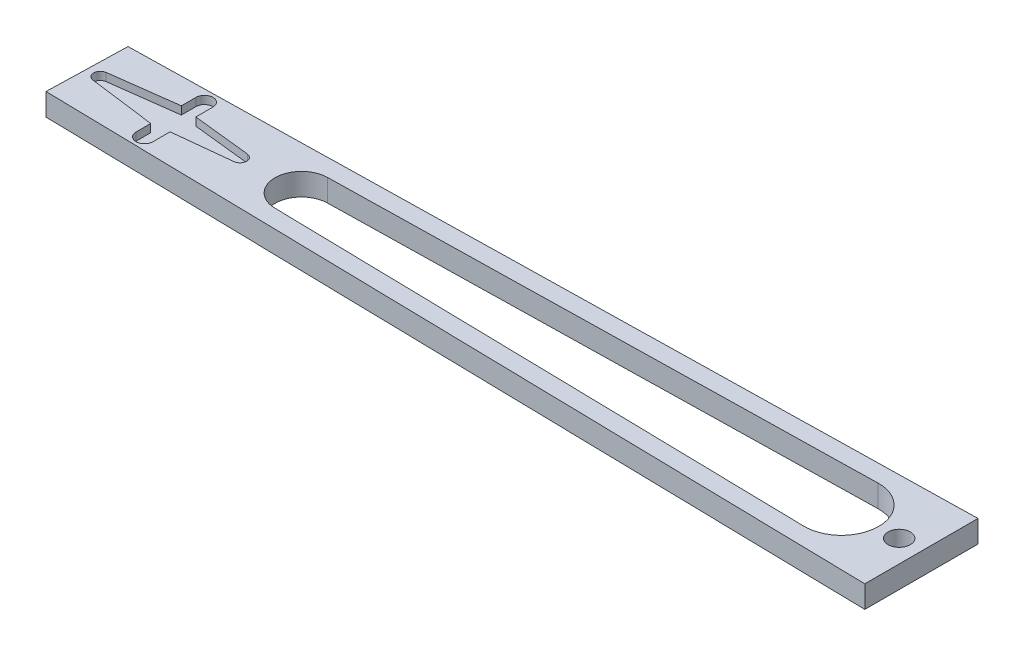
ISO-10303-21;
HEADER;
FILE_DESCRIPTION(('STEP AP214'),'2;1');
FILE_NAME('part.step','',(''),(''),'','','');
FILE_SCHEMA(('AUTOMOTIVE_DESIGN { 1 0 10303 214 1 1 1 1 }'));
ENDSEC;
DATA;
#1=APPLICATION_CONTEXT('core data for automotive mechanical design processes');
#2=APPLICATION_PROTOCOL_DEFINITION('international standard','automotive_design',2000,#1);
#3=PRODUCT_CONTEXT('',#1,'mechanical');
#4=PRODUCT('Part','Part','',(#3));
#5=PRODUCT_RELATED_PRODUCT_CATEGORY('part','',(#4));
#6=PRODUCT_DEFINITION_FORMATION('','',#4);
#7=PRODUCT_DEFINITION_CONTEXT('part definition',#1,'design');
#8=PRODUCT_DEFINITION('design','',#6,#7);
#9=PRODUCT_DEFINITION_SHAPE('','',#8);
#10=(LENGTH_UNIT() NAMED_UNIT(*) SI_UNIT(.MILLI.,.METRE.));
#11=(NAMED_UNIT(*) PLANE_ANGLE_UNIT() SI_UNIT($,.RADIAN.));
#12=(NAMED_UNIT(*) SI_UNIT($,.STERADIAN.) SOLID_ANGLE_UNIT());
#13=UNCERTAINTY_MEASURE_WITH_UNIT(LENGTH_MEASURE(1.E-05),#10,'distance_accuracy_value','');
#14=(GEOMETRIC_REPRESENTATION_CONTEXT(3) GLOBAL_UNCERTAINTY_ASSIGNED_CONTEXT((#13)) GLOBAL_UNIT_ASSIGNED_CONTEXT((#10,
#11,#12)) REPRESENTATION_CONTEXT('',''));
#15=CARTESIAN_POINT('',(0.,0.,0.));
#16=DIRECTION('',(0.,0.,1.));
#17=DIRECTION('',(1.,0.,0.));
#18=AXIS2_PLACEMENT_3D('',#15,#16,#17);
#19=CARTESIAN_POINT('',(79.6446575003003,5.,51.065389200042));
#20=DIRECTION('',(0.,-1.,0.));
#21=DIRECTION('',(0.,0.,-1.));
#22=AXIS2_PLACEMENT_3D('',#19,#20,#21);
#23=CYLINDRICAL_SURFACE('',#22,8.38109241557405);
#24=CARTESIAN_POINT('',(79.6446575003003,0.,51.065389200042));
#25=DIRECTION('',(0.,1.,0.));
#26=DIRECTION('',(0.,0.,1.));
#27=AXIS2_PLACEMENT_3D('',#24,#25,#26);
#28=CIRCLE('',#27,8.38109241557405);
#29=CARTESIAN_POINT('',(79.4739793423792,0.,59.4447435334499));
#30=VERTEX_POINT('',#29);
#31=CARTESIAN_POINT('',(79.4807981316153,0.,42.685898750994));
#32=VERTEX_POINT('',#31);
#33=EDGE_CURVE('E321',#30,#32,#28,.T.);
#34=ORIENTED_EDGE('',*,*,#33,.F.);
#35=DIRECTION('',(0.,-1.,0.));
#36=VECTOR('',#35,1.);
#37=CARTESIAN_POINT('',(79.4739793423792,5.,59.4447435334499));
#38=LINE('',#37,#36);
#39=CARTESIAN_POINT('',(79.4739793423792,5.,59.4447435334499));
#40=VERTEX_POINT('',#39);
#41=EDGE_CURVE('E11',#40,#30,#38,.T.);
#42=ORIENTED_EDGE('',*,*,#41,.F.);
#43=CARTESIAN_POINT('',(79.6446575003003,5.,51.065389200042));
#44=DIRECTION('',(0.,1.,0.));
#45=DIRECTION('',(0.,0.,1.));
#46=AXIS2_PLACEMENT_3D('',#43,#44,#45);
#47=CIRCLE('',#46,8.38109241557405);
#48=CARTESIAN_POINT('',(79.4807981316153,5.,42.685898750994));
#49=VERTEX_POINT('',#48);
#50=EDGE_CURVE('E289',#40,#49,#47,.T.);
#51=ORIENTED_EDGE('',*,*,#50,.T.);
#52=DIRECTION('',(0.,-1.,0.));
#53=VECTOR('',#52,1.);
#54=CARTESIAN_POINT('',(79.4807981316153,5.,42.685898750994));
#55=LINE('',#54,#53);
#56=EDGE_CURVE('E340',#49,#32,#55,.T.);
#57=ORIENTED_EDGE('',*,*,#56,.T.);
#58=EDGE_LOOP('',(#34,#42,#51,#57));
#59=FACE_BOUND('',#58,.T.);
#60=ADVANCED_FACE('F39',(#59),#23,.F.);
#61=CARTESIAN_POINT('',(-1.17736194692665,5.,57.8019651262589));
#62=DIRECTION('',(0.0203646672125864,0.,-0.99979261866115));
#63=DIRECTION('',(-0.99979261866115,0.,-0.0203646672125864));
#64=AXIS2_PLACEMENT_3D('',#61,#62,#63);
#65=PLANE('',#64);
#66=DIRECTION('',(0.99979261866115,0.,0.0203646672125864));
#67=VECTOR('',#66,1.);
#68=CARTESIAN_POINT('',(-1.17736194692665,0.,57.8019651262589));
#69=LINE('',#68,#67);
#70=CARTESIAN_POINT('',(-42.0612290827421,0.,56.9692060789883));
#71=VERTEX_POINT('',#70);
#72=EDGE_CURVE('E325',#71,#30,#69,.T.);
#73=ORIENTED_EDGE('',*,*,#72,.F.);
#74=DIRECTION('',(0.,-1.,0.));
#75=VECTOR('',#74,1.);
#76=CARTESIAN_POINT('',(-42.0612290827421,5.,56.9692060789883));
#77=LINE('',#76,#75);
#78=CARTESIAN_POINT('',(-42.0612290827421,5.,56.9692060789883));
#79=VERTEX_POINT('',#78);
#80=EDGE_CURVE('E49',#79,#71,#77,.T.);
#81=ORIENTED_EDGE('',*,*,#80,.F.);
#82=DIRECTION('',(0.99979261866115,0.,0.0203646672125864));
#83=VECTOR('',#82,1.);
#84=CARTESIAN_POINT('',(-1.17736194692665,5.,57.8019651262589));
#85=LINE('',#84,#83);
#86=EDGE_CURVE('E293',#79,#40,#85,.T.);
#87=ORIENTED_EDGE('',*,*,#86,.T.);
#88=ORIENTED_EDGE('',*,*,#41,.T.);
#89=EDGE_LOOP('',(#73,#81,#87,#88));
#90=FACE_BOUND('',#89,.T.);
#91=ADVANCED_FACE('F432',(#90),#65,.T.);
#92=CARTESIAN_POINT('',(-41.9399672293329,5.,51.0159192072626));
#93=DIRECTION('',(0.,-1.,0.));
#94=DIRECTION('',(0.,0.,-1.));
#95=AXIS2_PLACEMENT_3D('',#92,#93,#94);
#96=CYLINDRICAL_SURFACE('',#95,5.95452172841397);
#97=CARTESIAN_POINT('',(-41.9399672293329,0.,51.0159192072626));
#98=DIRECTION('',(0.,1.,0.));
#99=DIRECTION('',(0.,0.,1.));
#100=AXIS2_PLACEMENT_3D('',#97,#98,#99);
#101=CIRCLE('',#100,5.95452172841397);
#102=CARTESIAN_POINT('',(-42.0563845318585,0.,45.0625356293443));
#103=VERTEX_POINT('',#102);
#104=EDGE_CURVE('E329',#103,#71,#101,.T.);
#105=ORIENTED_EDGE('',*,*,#104,.F.);
#106=DIRECTION('',(0.,-1.,0.));
#107=VECTOR('',#106,1.);
#108=CARTESIAN_POINT('',(-42.0563845318585,5.,45.0625356293443));
#109=LINE('',#108,#107);
#110=CARTESIAN_POINT('',(-42.0563845318585,5.,45.0625356293443));
#111=VERTEX_POINT('',#110);
#112=EDGE_CURVE('E343',#111,#103,#109,.T.);
#113=ORIENTED_EDGE('',*,*,#112,.F.);
#114=CARTESIAN_POINT('',(-41.9399672293329,5.,51.0159192072626));
#115=DIRECTION('',(0.,1.,0.));
#116=DIRECTION('',(0.,0.,1.));
#117=AXIS2_PLACEMENT_3D('',#114,#115,#116);
#118=CIRCLE('',#117,5.95452172841397);
#119=EDGE_CURVE('E297',#111,#79,#118,.T.);
#120=ORIENTED_EDGE('',*,*,#119,.T.);
#121=ORIENTED_EDGE('',*,*,#80,.T.);
#122=EDGE_LOOP('',(#105,#113,#120,#121));
#123=FACE_BOUND('',#122,.T.);
#124=ADVANCED_FACE('F438',(#123),#96,.F.);
#125=CARTESIAN_POINT('',(-1.25578519073497,5.,61.8060064034692));
#126=DIRECTION('',(0.0203139813144181,0.,-0.999793649791374));
#127=DIRECTION('',(-0.999793649791374,0.,-0.0203139813144181));
#128=AXIS2_PLACEMENT_3D('',#125,#126,#127);
#129=PLANE('',#128);
#130=DIRECTION('',(0.999793649791375,0.,0.0203139813144181));
#131=VECTOR('',#130,1.);
#132=CARTESIAN_POINT('',(-1.25578519073497,0.,61.8060064034692));
#133=LINE('',#132,#131);
#134=CARTESIAN_POINT('',(-90.4800222588656,0.,59.9931328320344));
#135=VERTEX_POINT('',#134);
#136=CARTESIAN_POINT('',(97.6446575003003,0.,63.8154828041571));
#137=VERTEX_POINT('',#136);
#138=EDGE_CURVE('E230',#135,#137,#133,.T.);
#139=ORIENTED_EDGE('',*,*,#138,.T.);
#140=DIRECTION('',(0.,-1.,0.));
#141=VECTOR('',#140,1.);
#142=CARTESIAN_POINT('',(97.6446575003003,5.,63.8154828041571));
#143=LINE('',#142,#141);
#144=CARTESIAN_POINT('',(97.6446575003003,5.,63.8154828041571));
#145=VERTEX_POINT('',#144);
#146=EDGE_CURVE('E344',#145,#137,#143,.T.);
#147=ORIENTED_EDGE('',*,*,#146,.F.);
#148=DIRECTION('',(0.999793649791375,0.,0.0203139813144181));
#149=VECTOR('',#148,1.);
#150=CARTESIAN_POINT('',(-1.25578519073497,5.,61.8060064034692));
#151=LINE('',#150,#149);
#152=CARTESIAN_POINT('',(-90.4800222588656,5.,59.9931328320344));
#153=VERTEX_POINT('',#152);
#154=EDGE_CURVE('E276',#153,#145,#151,.T.);
#155=ORIENTED_EDGE('',*,*,#154,.F.);
#156=DIRECTION('',(0.,-1.,0.));
#157=VECTOR('',#156,1.);
#158=CARTESIAN_POINT('',(-90.4800222588656,5.,59.9931328320344));
#159=LINE('',#158,#157);
#160=EDGE_CURVE('E349',#153,#135,#159,.T.);
#161=ORIENTED_EDGE('',*,*,#160,.T.);
#162=EDGE_LOOP('',(#139,#147,#155,#161));
#163=FACE_BOUND('',#162,.T.);
#164=ADVANCED_FACE('F456',(#163),#129,.F.);
#165=CARTESIAN_POINT('',(97.6446575003003,5.,0.));
#166=DIRECTION('',(-1.,0.,0.));
#167=DIRECTION('',(0.,0.,1.));
#168=AXIS2_PLACEMENT_3D('',#165,#166,#167);
#169=PLANE('',#168);
#170=DIRECTION('',(0.,0.,-1.));
#171=VECTOR('',#170,1.);
#172=CARTESIAN_POINT('',(97.6446575003003,0.,0.));
#173=LINE('',#172,#171);
#174=CARTESIAN_POINT('',(97.6446575003003,0.,38.3299431695327));
#175=VERTEX_POINT('',#174);
#176=EDGE_CURVE('E312',#137,#175,#173,.T.);
#177=ORIENTED_EDGE('',*,*,#176,.T.);
#178=DIRECTION('',(0.,-1.,0.));
#179=VECTOR('',#178,1.);
#180=CARTESIAN_POINT('',(97.6446575003003,5.,38.3299431695327));
#181=LINE('',#180,#179);
#182=CARTESIAN_POINT('',(97.6446575003003,5.,38.3299431695327));
#183=VERTEX_POINT('',#182);
#184=EDGE_CURVE('E357',#183,#175,#181,.T.);
#185=ORIENTED_EDGE('',*,*,#184,.F.);
#186=DIRECTION('',(0.,0.,-1.));
#187=VECTOR('',#186,1.);
#188=CARTESIAN_POINT('',(97.6446575003003,5.,0.));
#189=LINE('',#188,#187);
#190=EDGE_CURVE('E280',#145,#183,#189,.T.);
#191=ORIENTED_EDGE('',*,*,#190,.F.);
#192=ORIENTED_EDGE('',*,*,#146,.T.);
#193=EDGE_LOOP('',(#177,#185,#191,#192));
#194=FACE_BOUND('',#193,.T.);
#195=ADVANCED_FACE('F452',(#194),#169,.F.);
#196=CARTESIAN_POINT('',(0.786572502605061,5.,40.2239849082597));
#197=DIRECTION('',(0.0195510752727798,0.,0.999808859460486));
#198=DIRECTION('',(0.999808859460486,0.,-0.0195510752727798));
#199=AXIS2_PLACEMENT_3D('',#196,#197,#198);
#200=PLANE('',#199);
#201=DIRECTION('',(-0.999808859460486,0.,0.0195510752727798));
#202=VECTOR('',#201,1.);
#203=CARTESIAN_POINT('',(0.786572502605061,0.,40.2239849082597));
#204=LINE('',#203,#202);
#205=CARTESIAN_POINT('',(-90.0051032092329,0.,41.9993991478793));
#206=VERTEX_POINT('',#205);
#207=EDGE_CURVE('E315',#175,#206,#204,.T.);
#208=ORIENTED_EDGE('',*,*,#207,.T.);
#209=DIRECTION('',(0.,-1.,0.));
#210=VECTOR('',#209,1.);
#211=CARTESIAN_POINT('',(-90.0051032092329,5.,41.9993991478793));
#212=LINE('',#211,#210);
#213=CARTESIAN_POINT('',(-90.0051032092329,5.,41.9993991478793));
#214=VERTEX_POINT('',#213);
#215=EDGE_CURVE('E353',#214,#206,#212,.T.);
#216=ORIENTED_EDGE('',*,*,#215,.F.);
#217=DIRECTION('',(-0.999808859460486,0.,0.0195510752727798));
#218=VECTOR('',#217,1.);
#219=CARTESIAN_POINT('',(0.786572502605061,5.,40.2239849082597));
#220=LINE('',#219,#218);
#221=EDGE_CURVE('E283',#183,#214,#220,.T.);
#222=ORIENTED_EDGE('',*,*,#221,.F.);
#223=ORIENTED_EDGE('',*,*,#184,.T.);
#224=EDGE_LOOP('',(#208,#216,#222,#223));
#225=FACE_BOUND('',#224,.T.);
#226=ADVANCED_FACE('F449',(#225),#200,.F.);
#227=CARTESIAN_POINT('',(-70.5502544115956,5.,44.2474834915236));
#228=DIRECTION('',(0.,-1.,0.));
#229=DIRECTION('',(0.,0.,-1.));
#230=AXIS2_PLACEMENT_3D('',#227,#228,#229);
#231=CYLINDRICAL_SURFACE('',#230,1.90000000000001);
#232=CARTESIAN_POINT('',(-70.5502544115956,3.2,44.2474834915236));
#233=DIRECTION('',(0.,1.,0.));
#234=DIRECTION('',(0.,0.,1.));
#235=AXIS2_PLACEMENT_3D('',#232,#233,#234);
#236=CIRCLE('',#235,1.90000000000001);
#237=CARTESIAN_POINT('',(-68.6502544115956,3.2,44.2474834915236));
#238=VERTEX_POINT('',#237);
#239=CARTESIAN_POINT('',(-72.4502544115956,3.2,44.2474834915236));
#240=VERTEX_POINT('',#239);
#241=EDGE_CURVE('E57',#238,#240,#236,.T.);
#242=ORIENTED_EDGE('',*,*,#241,.F.);
#243=DIRECTION('',(0.,-1.,0.));
#244=VECTOR('',#243,1.);
#245=CARTESIAN_POINT('',(-68.6502544115956,5.,44.2474834915236));
#246=LINE('',#245,#244);
#247=CARTESIAN_POINT('',(-68.6502544115956,5.,44.2474834915236));
#248=VERTEX_POINT('',#247);
#249=EDGE_CURVE('E43',#248,#238,#246,.T.);
#250=ORIENTED_EDGE('',*,*,#249,.F.);
#251=CARTESIAN_POINT('',(-70.5502544115956,5.,44.2474834915236));
#252=DIRECTION('',(0.,1.,0.));
#253=DIRECTION('',(0.,0.,1.));
#254=AXIS2_PLACEMENT_3D('',#251,#252,#253);
#255=CIRCLE('',#254,1.90000000000001);
#256=CARTESIAN_POINT('',(-72.4502544115956,5.,44.2474834915236));
#257=VERTEX_POINT('',#256);
#258=EDGE_CURVE('E231',#248,#257,#255,.T.);
#259=ORIENTED_EDGE('',*,*,#258,.T.);
#260=DIRECTION('',(0.,-1.,0.));
#261=VECTOR('',#260,1.);
#262=CARTESIAN_POINT('',(-72.4502544115956,5.,44.2474834915236));
#263=LINE('',#262,#261);
#264=EDGE_CURVE('E190',#257,#240,#263,.T.);
#265=ORIENTED_EDGE('',*,*,#264,.T.);
#266=EDGE_LOOP('',(#242,#250,#259,#265));
#267=FACE_BOUND('',#266,.T.);
#268=ADVANCED_FACE('F41',(#267),#231,.F.);
#269=CARTESIAN_POINT('',(-68.6502544115956,5.,0.));
#270=DIRECTION('',(-1.,0.,0.));
#271=DIRECTION('',(0.,0.,1.));
#272=AXIS2_PLACEMENT_3D('',#269,#270,#271);
#273=PLANE('',#272);
#274=DIRECTION('',(0.,0.,-1.));
#275=VECTOR('',#274,1.);
#276=CARTESIAN_POINT('',(-68.6502544115956,3.2,48.0974834915235));
#277=LINE('',#276,#275);
#278=CARTESIAN_POINT('',(-68.6502544115956,3.2,48.0974834915235));
#279=VERTEX_POINT('',#278);
#280=EDGE_CURVE('E64',#279,#238,#277,.T.);
#281=ORIENTED_EDGE('',*,*,#280,.F.);
#282=DIRECTION('',(0.,-1.,0.));
#283=VECTOR('',#282,1.);
#284=CARTESIAN_POINT('',(-68.6502544115956,5.,48.0974834915235));
#285=LINE('',#284,#283);
#286=CARTESIAN_POINT('',(-68.6502544115956,5.,48.0974834915235));
#287=VERTEX_POINT('',#286);
#288=EDGE_CURVE('E395',#287,#279,#285,.T.);
#289=ORIENTED_EDGE('',*,*,#288,.F.);
#290=DIRECTION('',(0.,0.,-1.));
#291=VECTOR('',#290,1.);
#292=CARTESIAN_POINT('',(-68.6502544115956,5.,0.));
#293=LINE('',#292,#291);
#294=EDGE_CURVE('E235',#287,#248,#293,.T.);
#295=ORIENTED_EDGE('',*,*,#294,.T.);
#296=ORIENTED_EDGE('',*,*,#249,.T.);
#297=EDGE_LOOP('',(#281,#289,#295,#296));
#298=FACE_BOUND('',#297,.T.);
#299=ADVANCED_FACE('F400',(#298),#273,.T.);
#300=CARTESIAN_POINT('',(-5.96789962169583,5.,54.910108873483));
#301=DIRECTION('',(-0.108048615095357,0.,0.994145611455372));
#302=DIRECTION('',(0.994145611455372,0.,0.108048615095357));
#303=AXIS2_PLACEMENT_3D('',#300,#301,#302);
#304=PLANE('',#303);
#305=DIRECTION('',(-0.994145611455372,0.,-0.108048615095357));
#306=VECTOR('',#305,1.);
#307=CARTESIAN_POINT('',(-55.6448437245371,3.2,49.5109752348768));
#308=LINE('',#307,#306);
#309=CARTESIAN_POINT('',(-55.6448437245371,3.2,49.5109752348768));
#310=VERTEX_POINT('',#309);
#311=EDGE_CURVE('E403',#310,#279,#308,.T.);
#312=ORIENTED_EDGE('',*,*,#311,.F.);
#313=DIRECTION('',(0.,-1.,0.));
#314=VECTOR('',#313,1.);
#315=CARTESIAN_POINT('',(-55.6448437245371,5.,49.5109752348768));
#316=LINE('',#315,#314);
#317=CARTESIAN_POINT('',(-55.6448437245371,5.,49.5109752348768));
#318=VERTEX_POINT('',#317);
#319=EDGE_CURVE('E392',#318,#310,#316,.T.);
#320=ORIENTED_EDGE('',*,*,#319,.F.);
#321=DIRECTION('',(-0.994145611455372,0.,-0.108048615095357));
#322=VECTOR('',#321,1.);
#323=CARTESIAN_POINT('',(-5.96789962169583,5.,54.910108873483));
#324=LINE('',#323,#322);
#325=EDGE_CURVE('E240',#318,#287,#324,.T.);
#326=ORIENTED_EDGE('',*,*,#325,.T.);
#327=ORIENTED_EDGE('',*,*,#288,.T.);
#328=EDGE_LOOP('',(#312,#320,#326,#327));
#329=FACE_BOUND('',#328,.T.);
#330=ADVANCED_FACE('F423',(#329),#304,.T.);
#331=CARTESIAN_POINT('',(-55.8077951531249,5.,51.0102767064218));
#332=DIRECTION('',(0.,-1.,0.));
#333=DIRECTION('',(0.,0.,-1.));
#334=AXIS2_PLACEMENT_3D('',#331,#332,#333);
#335=CYLINDRICAL_SURFACE('',#334,1.5081306543718);
#336=CARTESIAN_POINT('',(-55.8077951531249,3.2,51.0102767064218));
#337=DIRECTION('',(0.,1.,0.));
#338=DIRECTION('',(0.,0.,1.));
#339=AXIS2_PLACEMENT_3D('',#336,#337,#338);
#340=CIRCLE('',#339,1.5081306543718);
#341=CARTESIAN_POINT('',(-55.64088875901,3.2,52.509143053452));
#342=VERTEX_POINT('',#341);
#343=EDGE_CURVE('E406',#342,#310,#340,.T.);
#344=ORIENTED_EDGE('',*,*,#343,.F.);
#345=DIRECTION('',(0.,-1.,0.));
#346=VECTOR('',#345,1.);
#347=CARTESIAN_POINT('',(-55.64088875901,5.,52.509143053452));
#348=LINE('',#347,#346);
#349=CARTESIAN_POINT('',(-55.64088875901,5.,52.509143053452));
#350=VERTEX_POINT('',#349);
#351=EDGE_CURVE('E388',#350,#342,#348,.T.);
#352=ORIENTED_EDGE('',*,*,#351,.F.);
#353=CARTESIAN_POINT('',(-55.8077951531249,5.,51.0102767064218));
#354=DIRECTION('',(0.,1.,0.));
#355=DIRECTION('',(0.,0.,1.));
#356=AXIS2_PLACEMENT_3D('',#353,#354,#355);
#357=CIRCLE('',#356,1.5081306543718);
#358=EDGE_CURVE('E244',#350,#318,#357,.T.);
#359=ORIENTED_EDGE('',*,*,#358,.T.);
#360=ORIENTED_EDGE('',*,*,#319,.T.);
#361=EDGE_LOOP('',(#344,#352,#359,#360));
#362=FACE_BOUND('',#361,.T.);
#363=ADVANCED_FACE('F412',(#362),#335,.F.);
#364=CARTESIAN_POINT('',(4.91404797201048,5.,46.0468089448067));
#365=DIRECTION('',(0.106115976085142,0.,0.994353759795526));
#366=DIRECTION('',(0.994353759795526,0.,-0.106115976085142));
#367=AXIS2_PLACEMENT_3D('',#364,#365,#366);
#368=PLANE('',#367);
#369=ORIENTED_EDGE('',*,*,#351,.T.);
#370=DIRECTION('',(-0.994353759795526,0.,0.106115976085142));
#371=VECTOR('',#370,1.);
#372=CARTESIAN_POINT('',(-55.64088875901,3.2,52.509143053452));
#373=LINE('',#372,#371);
#374=CARTESIAN_POINT('',(-68.6502544115956,3.2,53.8974834915235));
#375=VERTEX_POINT('',#374);
#376=EDGE_CURVE('E227',#342,#375,#373,.T.);
#377=ORIENTED_EDGE('',*,*,#376,.T.);
#378=DIRECTION('',(0.,-1.,0.));
#379=VECTOR('',#378,1.);
#380=CARTESIAN_POINT('',(-68.6502544115956,5.,53.8974834915235));
#381=LINE('',#380,#379);
#382=CARTESIAN_POINT('',(-68.6502544115956,5.,53.8974834915235));
#383=VERTEX_POINT('',#382);
#384=EDGE_CURVE('E384',#383,#375,#381,.T.);
#385=ORIENTED_EDGE('',*,*,#384,.F.);
#386=DIRECTION('',(-0.994353759795526,0.,0.106115976085142));
#387=VECTOR('',#386,1.);
#388=CARTESIAN_POINT('',(4.91404797201048,5.,46.0468089448067));
#389=LINE('',#388,#387);
#390=EDGE_CURVE('E248',#350,#383,#389,.T.);
#391=ORIENTED_EDGE('',*,*,#390,.F.);
#392=EDGE_LOOP('',(#369,#377,#385,#391));
#393=FACE_BOUND('',#392,.T.);
#394=ADVANCED_FACE('F415',(#393),#368,.F.);
#395=CARTESIAN_POINT('',(-68.6502544115954,5.,-2.47458094461453E-13));
#396=DIRECTION('',(-1.,0.,0.));
#397=DIRECTION('',(0.,0.,1.));
#398=AXIS2_PLACEMENT_3D('',#395,#396,#397);
#399=PLANE('',#398);
#400=DIRECTION('',(0.,0.,-1.));
#401=VECTOR('',#400,1.);
#402=CARTESIAN_POINT('',(-68.6502544115956,3.2,57.7474834915236));
#403=LINE('',#402,#401);
#404=CARTESIAN_POINT('',(-68.6502544115956,3.2,57.7474834915236));
#405=VERTEX_POINT('',#404);
#406=EDGE_CURVE('E223',#405,#375,#403,.T.);
#407=ORIENTED_EDGE('',*,*,#406,.F.);
#408=DIRECTION('',(0.,-1.,0.));
#409=VECTOR('',#408,1.);
#410=CARTESIAN_POINT('',(-68.6502544115956,5.,57.7474834915236));
#411=LINE('',#410,#409);
#412=CARTESIAN_POINT('',(-68.6502544115956,5.,57.7474834915236));
#413=VERTEX_POINT('',#412);
#414=EDGE_CURVE('E380',#413,#405,#411,.T.);
#415=ORIENTED_EDGE('',*,*,#414,.F.);
#416=DIRECTION('',(0.,0.,-1.));
#417=VECTOR('',#416,1.);
#418=CARTESIAN_POINT('',(-68.6502544115954,5.,-2.47458094461453E-13));
#419=LINE('',#418,#417);
#420=EDGE_CURVE('E251',#413,#383,#419,.T.);
#421=ORIENTED_EDGE('',*,*,#420,.T.);
#422=ORIENTED_EDGE('',*,*,#384,.T.);
#423=EDGE_LOOP('',(#407,#415,#421,#422));
#424=FACE_BOUND('',#423,.T.);
#425=ADVANCED_FACE('F481',(#424),#399,.T.);
#426=CARTESIAN_POINT('',(-70.5502544115956,5.,57.7474834915236));
#427=DIRECTION('',(0.,-1.,0.));
#428=DIRECTION('',(0.,0.,-1.));
#429=AXIS2_PLACEMENT_3D('',#426,#427,#428);
#430=CYLINDRICAL_SURFACE('',#429,1.9);
#431=CARTESIAN_POINT('',(-70.5502544115956,3.2,57.7474834915236));
#432=DIRECTION('',(0.,1.,0.));
#433=DIRECTION('',(0.,0.,1.));
#434=AXIS2_PLACEMENT_3D('',#431,#432,#433);
#435=CIRCLE('',#434,1.9);
#436=CARTESIAN_POINT('',(-72.4502544115956,3.2,57.7474834915236));
#437=VERTEX_POINT('',#436);
#438=EDGE_CURVE('E219',#437,#405,#435,.T.);
#439=ORIENTED_EDGE('',*,*,#438,.F.);
#440=DIRECTION('',(0.,-1.,0.));
#441=VECTOR('',#440,1.);
#442=CARTESIAN_POINT('',(-72.4502544115956,5.,57.7474834915236));
#443=LINE('',#442,#441);
#444=CARTESIAN_POINT('',(-72.4502544115956,5.,57.7474834915236));
#445=VERTEX_POINT('',#444);
#446=EDGE_CURVE('E376',#445,#437,#443,.T.);
#447=ORIENTED_EDGE('',*,*,#446,.F.);
#448=CARTESIAN_POINT('',(-70.5502544115956,5.,57.7474834915236));
#449=DIRECTION('',(0.,1.,0.));
#450=DIRECTION('',(0.,0.,1.));
#451=AXIS2_PLACEMENT_3D('',#448,#449,#450);
#452=CIRCLE('',#451,1.9);
#453=EDGE_CURVE('E255',#445,#413,#452,.T.);
#454=ORIENTED_EDGE('',*,*,#453,.T.);
#455=ORIENTED_EDGE('',*,*,#414,.T.);
#456=EDGE_LOOP('',(#439,#447,#454,#455));
#457=FACE_BOUND('',#456,.T.);
#458=ADVANCED_FACE('F477',(#457),#430,.F.);
#459=CARTESIAN_POINT('',(-72.4502544115954,5.,-3.04681593135245E-13));
#460=DIRECTION('',(1.,0.,0.));
#461=DIRECTION('',(0.,0.,-1.));
#462=AXIS2_PLACEMENT_3D('',#459,#460,#461);
#463=PLANE('',#462);
#464=DIRECTION('',(0.,0.,1.));
#465=VECTOR('',#464,1.);
#466=CARTESIAN_POINT('',(-72.4502544115956,3.2,54.4474834915236));
#467=LINE('',#466,#465);
#468=CARTESIAN_POINT('',(-72.4502544115956,3.2,54.4474834915236));
#469=VERTEX_POINT('',#468);
#470=EDGE_CURVE('E215',#469,#437,#467,.T.);
#471=ORIENTED_EDGE('',*,*,#470,.F.);
#472=DIRECTION('',(0.,-1.,0.));
#473=VECTOR('',#472,1.);
#474=CARTESIAN_POINT('',(-72.4502544115956,5.,54.4474834915236));
#475=LINE('',#474,#473);
#476=CARTESIAN_POINT('',(-72.4502544115956,5.,54.4474834915236));
#477=VERTEX_POINT('',#476);
#478=EDGE_CURVE('E372',#477,#469,#475,.T.);
#479=ORIENTED_EDGE('',*,*,#478,.F.);
#480=DIRECTION('',(0.,0.,1.));
#481=VECTOR('',#480,1.);
#482=CARTESIAN_POINT('',(-72.4502544115954,5.,-3.04681593135245E-13));
#483=LINE('',#482,#481);
#484=EDGE_CURVE('E259',#477,#445,#483,.T.);
#485=ORIENTED_EDGE('',*,*,#484,.T.);
#486=ORIENTED_EDGE('',*,*,#446,.T.);
#487=EDGE_LOOP('',(#471,#479,#485,#486));
#488=FACE_BOUND('',#487,.T.);
#489=ADVANCED_FACE('F473',(#488),#463,.T.);
#490=CARTESIAN_POINT('',(-8.22707381919204,5.,62.8537987521285));
#491=DIRECTION('',(0.129785160623963,0.,-0.991542138328882));
#492=DIRECTION('',(-0.991542138328882,0.,-0.129785160623963));
#493=AXIS2_PLACEMENT_3D('',#490,#491,#492);
#494=PLANE('',#493);
#495=DIRECTION('',(0.991542138328882,0.,0.129785160623963));
#496=VECTOR('',#495,1.);
#497=CARTESIAN_POINT('',(-87.4449321525315,3.2,52.4847966990169));
#498=LINE('',#497,#496);
#499=CARTESIAN_POINT('',(-87.4449321525315,3.2,52.4847966990169));
#500=VERTEX_POINT('',#499);
#501=EDGE_CURVE('E211',#500,#469,#498,.T.);
#502=ORIENTED_EDGE('',*,*,#501,.F.);
#503=DIRECTION('',(0.,-1.,0.));
#504=VECTOR('',#503,1.);
#505=CARTESIAN_POINT('',(-87.4449321525315,5.,52.4847966990169));
#506=LINE('',#505,#504);
#507=CARTESIAN_POINT('',(-87.4449321525315,5.,52.4847966990169));
#508=VERTEX_POINT('',#507);
#509=EDGE_CURVE('E368',#508,#500,#506,.T.);
#510=ORIENTED_EDGE('',*,*,#509,.F.);
#511=DIRECTION('',(0.991542138328882,0.,0.129785160623963));
#512=VECTOR('',#511,1.);
#513=CARTESIAN_POINT('',(-8.22707381919204,5.,62.8537987521285));
#514=LINE('',#513,#512);
#515=EDGE_CURVE('E263',#508,#477,#514,.T.);
#516=ORIENTED_EDGE('',*,*,#515,.T.);
#517=ORIENTED_EDGE('',*,*,#478,.T.);
#518=EDGE_LOOP('',(#502,#510,#516,#517));
#519=FACE_BOUND('',#518,.T.);
#520=ADVANCED_FACE('F469',(#519),#494,.T.);
#521=CARTESIAN_POINT('',(-87.2502544115956,5.,50.9974834915236));
#522=DIRECTION('',(0.,-1.,0.));
#523=DIRECTION('',(0.,0.,-1.));
#524=AXIS2_PLACEMENT_3D('',#521,#522,#523);
#525=CYLINDRICAL_SURFACE('',#524,1.5);
#526=CARTESIAN_POINT('',(-87.2502544115956,3.2,50.9974834915236));
#527=DIRECTION('',(0.,1.,0.));
#528=DIRECTION('',(0.,0.,1.));
#529=AXIS2_PLACEMENT_3D('',#526,#527,#528);
#530=CIRCLE('',#529,1.5);
#531=CARTESIAN_POINT('',(-87.4449321525315,3.2,49.5101702840303));
#532=VERTEX_POINT('',#531);
#533=EDGE_CURVE('E199',#532,#500,#530,.T.);
#534=ORIENTED_EDGE('',*,*,#533,.F.);
#535=DIRECTION('',(0.,-1.,0.));
#536=VECTOR('',#535,1.);
#537=CARTESIAN_POINT('',(-87.4449321525315,5.,49.5101702840303));
#538=LINE('',#537,#536);
#539=CARTESIAN_POINT('',(-87.4449321525315,5.,49.5101702840303));
#540=VERTEX_POINT('',#539);
#541=EDGE_CURVE('E189',#540,#532,#538,.T.);
#542=ORIENTED_EDGE('',*,*,#541,.F.);
#543=CARTESIAN_POINT('',(-87.2502544115956,5.,50.9974834915236));
#544=DIRECTION('',(0.,1.,0.));
#545=DIRECTION('',(0.,0.,1.));
#546=AXIS2_PLACEMENT_3D('',#543,#544,#545);
#547=CIRCLE('',#546,1.5);
#548=EDGE_CURVE('E267',#540,#508,#547,.T.);
#549=ORIENTED_EDGE('',*,*,#548,.T.);
#550=ORIENTED_EDGE('',*,*,#509,.T.);
#551=EDGE_LOOP('',(#534,#542,#549,#550));
#552=FACE_BOUND('',#551,.T.);
#553=ADVANCED_FACE('F466',(#552),#525,.F.);
#554=CARTESIAN_POINT('',(4.89839897488296,5.,37.4231458403468));
#555=DIRECTION('',(-0.129785160623964,0.,-0.991542138328882));
#556=DIRECTION('',(-0.991542138328882,0.,0.129785160623964));
#557=AXIS2_PLACEMENT_3D('',#554,#555,#556);
#558=PLANE('',#557);
#559=ORIENTED_EDGE('',*,*,#541,.T.);
#560=DIRECTION('',(0.991542138328882,0.,-0.129785160623964));
#561=VECTOR('',#560,1.);
#562=CARTESIAN_POINT('',(-87.4449321525315,3.2,49.5101702840303));
#563=LINE('',#562,#561);
#564=CARTESIAN_POINT('',(-72.4502544115956,3.2,47.5474834915236));
#565=VERTEX_POINT('',#564);
#566=EDGE_CURVE('E194',#532,#565,#563,.T.);
#567=ORIENTED_EDGE('',*,*,#566,.T.);
#568=DIRECTION('',(0.,-1.,0.));
#569=VECTOR('',#568,1.);
#570=CARTESIAN_POINT('',(-72.4502544115956,5.,47.5474834915236));
#571=LINE('',#570,#569);
#572=CARTESIAN_POINT('',(-72.4502544115956,5.,47.5474834915236));
#573=VERTEX_POINT('',#572);
#574=EDGE_CURVE('E179',#573,#565,#571,.T.);
#575=ORIENTED_EDGE('',*,*,#574,.F.);
#576=DIRECTION('',(0.991542138328882,0.,-0.129785160623964));
#577=VECTOR('',#576,1.);
#578=CARTESIAN_POINT('',(4.89839897488296,5.,37.4231458403468));
#579=LINE('',#578,#577);
#580=EDGE_CURVE('E271',#540,#573,#579,.T.);
#581=ORIENTED_EDGE('',*,*,#580,.F.);
#582=EDGE_LOOP('',(#559,#567,#575,#581));
#583=FACE_BOUND('',#582,.T.);
#584=ADVANCED_FACE('F195',(#583),#558,.F.);
#585=CARTESIAN_POINT('',(0.86477680369618,5.,44.2232203461017));
#586=DIRECTION('',(0.0195510752727798,0.,0.999808859460486));
#587=DIRECTION('',(0.999808859460486,0.,-0.0195510752727798));
#588=AXIS2_PLACEMENT_3D('',#585,#586,#587);
#589=PLANE('',#588);
#590=DIRECTION('',(-0.999808859460486,0.,0.0195510752727798));
#591=VECTOR('',#590,1.);
#592=CARTESIAN_POINT('',(0.86477680369618,0.,44.2232203461017));
#593=LINE('',#592,#591);
#594=EDGE_CURVE('E333',#32,#103,#593,.T.);
#595=ORIENTED_EDGE('',*,*,#594,.F.);
#596=ORIENTED_EDGE('',*,*,#56,.F.);
#597=DIRECTION('',(-0.999808859460486,0.,0.0195510752727798));
#598=VECTOR('',#597,1.);
#599=CARTESIAN_POINT('',(0.86477680369618,5.,44.2232203461017));
#600=LINE('',#599,#598);
#601=EDGE_CURVE('E301',#49,#111,#600,.T.);
#602=ORIENTED_EDGE('',*,*,#601,.T.);
#603=ORIENTED_EDGE('',*,*,#112,.T.);
#604=EDGE_LOOP('',(#595,#596,#602,#603));
#605=FACE_BOUND('',#604,.T.);
#606=ADVANCED_FACE('F447',(#605),#589,.T.);
#607=CARTESIAN_POINT('',(-88.8347045809716,5.,-2.34466588283152));
#608=DIRECTION('',(0.999651871341947,0.,0.0263843916462599));
#609=DIRECTION('',(0.0263843916462599,0.,-0.999651871341947));
#610=AXIS2_PLACEMENT_3D('',#607,#608,#609);
#611=PLANE('',#610);
#612=DIRECTION('',(-0.0263843916462599,0.,0.999651871341947));
#613=VECTOR('',#612,1.);
#614=CARTESIAN_POINT('',(-88.8347045809716,0.,-2.34466588283152));
#615=LINE('',#614,#613);
#616=EDGE_CURVE('E318',#206,#135,#615,.T.);
#617=ORIENTED_EDGE('',*,*,#616,.T.);
#618=ORIENTED_EDGE('',*,*,#160,.F.);
#619=DIRECTION('',(-0.0263843916462599,0.,0.999651871341947));
#620=VECTOR('',#619,1.);
#621=CARTESIAN_POINT('',(-88.8347045809716,5.,-2.34466588283152));
#622=LINE('',#621,#620);
#623=EDGE_CURVE('E286',#214,#153,#622,.T.);
#624=ORIENTED_EDGE('',*,*,#623,.F.);
#625=ORIENTED_EDGE('',*,*,#215,.T.);
#626=EDGE_LOOP('',(#617,#618,#624,#625));
#627=FACE_BOUND('',#626,.T.);
#628=ADVANCED_FACE('F444',(#627),#611,.F.);
#629=CARTESIAN_POINT('',(-72.4502544115956,5.,0.));
#630=DIRECTION('',(1.,0.,0.));
#631=DIRECTION('',(0.,0.,-1.));
#632=AXIS2_PLACEMENT_3D('',#629,#630,#631);
#633=PLANE('',#632);
#634=DIRECTION('',(0.,0.,1.));
#635=VECTOR('',#634,1.);
#636=CARTESIAN_POINT('',(-72.4502544115956,3.2,44.2474834915236));
#637=LINE('',#636,#635);
#638=EDGE_CURVE('E183',#240,#565,#637,.T.);
#639=ORIENTED_EDGE('',*,*,#638,.F.);
#640=ORIENTED_EDGE('',*,*,#264,.F.);
#641=DIRECTION('',(0.,0.,1.));
#642=VECTOR('',#641,1.);
#643=CARTESIAN_POINT('',(-72.4502544115956,5.,0.));
#644=LINE('',#643,#642);
#645=EDGE_CURVE('E185',#257,#573,#644,.T.);
#646=ORIENTED_EDGE('',*,*,#645,.T.);
#647=ORIENTED_EDGE('',*,*,#574,.T.);
#648=EDGE_LOOP('',(#639,#640,#646,#647));
#649=FACE_BOUND('',#648,.T.);
#650=ADVANCED_FACE('F181',(#649),#633,.T.);
#651=CARTESIAN_POINT('',(92.6446575003003,5.,51.0706786016219));
#652=DIRECTION('',(0.,-1.,0.));
#653=DIRECTION('',(0.,0.,-1.));
#654=AXIS2_PLACEMENT_3D('',#651,#652,#653);
#655=CYLINDRICAL_SURFACE('',#654,2.5);
#656=CARTESIAN_POINT('',(92.6446575003003,5.,51.0706786016219));
#657=DIRECTION('',(0.,1.,0.));
#658=DIRECTION('',(0.,0.,1.));
#659=AXIS2_PLACEMENT_3D('',#656,#657,#658);
#660=CIRCLE('',#659,2.5);
#661=CARTESIAN_POINT('',(92.6446575003003,5.,53.5706786016219));
#662=VERTEX_POINT('',#661);
#663=EDGE_CURVE('E305',#662,#662,#660,.T.);
#664=ORIENTED_EDGE('',*,*,#663,.T.);
#665=EDGE_LOOP('',(#664));
#666=FACE_BOUND('',#665,.T.);
#667=CARTESIAN_POINT('',(92.6446575003003,0.,51.0706786016219));
#668=DIRECTION('',(0.,1.,0.));
#669=DIRECTION('',(0.,0.,1.));
#670=AXIS2_PLACEMENT_3D('',#667,#668,#669);
#671=CIRCLE('',#670,2.5);
#672=CARTESIAN_POINT('',(92.6446575003003,0.,53.5706786016219));
#673=VERTEX_POINT('',#672);
#674=EDGE_CURVE('E236',#673,#673,#671,.T.);
#675=ORIENTED_EDGE('',*,*,#674,.F.);
#676=EDGE_LOOP('',(#675));
#677=FACE_BOUND('',#676,.T.);
#678=ADVANCED_FACE('F463',(#666,#677),#655,.F.);
#679=CARTESIAN_POINT('',(0.,5.,0.));
#680=DIRECTION('',(0.,1.,0.));
#681=DIRECTION('',(0.,0.,1.));
#682=AXIS2_PLACEMENT_3D('',#679,#680,#681);
#683=PLANE('',#682);
#684=ORIENTED_EDGE('',*,*,#258,.F.);
#685=ORIENTED_EDGE('',*,*,#294,.F.);
#686=ORIENTED_EDGE('',*,*,#325,.F.);
#687=ORIENTED_EDGE('',*,*,#358,.F.);
#688=ORIENTED_EDGE('',*,*,#390,.T.);
#689=ORIENTED_EDGE('',*,*,#420,.F.);
#690=ORIENTED_EDGE('',*,*,#453,.F.);
#691=ORIENTED_EDGE('',*,*,#484,.F.);
#692=ORIENTED_EDGE('',*,*,#515,.F.);
#693=ORIENTED_EDGE('',*,*,#548,.F.);
#694=ORIENTED_EDGE('',*,*,#580,.T.);
#695=ORIENTED_EDGE('',*,*,#645,.F.);
#696=EDGE_LOOP('',(#684,#685,#686,#687,#688,#689,#690,#691,#692,#693,#694,#695));
#697=FACE_BOUND('',#696,.T.);
#698=ORIENTED_EDGE('',*,*,#154,.T.);
#699=ORIENTED_EDGE('',*,*,#190,.T.);
#700=ORIENTED_EDGE('',*,*,#221,.T.);
#701=ORIENTED_EDGE('',*,*,#623,.T.);
#702=EDGE_LOOP('',(#698,#699,#700,#701));
#703=FACE_BOUND('',#702,.T.);
#704=ORIENTED_EDGE('',*,*,#50,.F.);
#705=ORIENTED_EDGE('',*,*,#86,.F.);
#706=ORIENTED_EDGE('',*,*,#119,.F.);
#707=ORIENTED_EDGE('',*,*,#601,.F.);
#708=EDGE_LOOP('',(#704,#705,#706,#707));
#709=FACE_BOUND('',#708,.T.);
#710=ORIENTED_EDGE('',*,*,#663,.F.);
#711=EDGE_LOOP('',(#710));
#712=FACE_BOUND('',#711,.T.);
#713=ADVANCED_FACE('F421',(#697,#703,#709,#712),#683,.T.);
#714=CARTESIAN_POINT('',(0.,0.,0.));
#715=DIRECTION('',(0.,1.,0.));
#716=DIRECTION('',(0.,0.,1.));
#717=AXIS2_PLACEMENT_3D('',#714,#715,#716);
#718=PLANE('',#717);
#719=ORIENTED_EDGE('',*,*,#138,.F.);
#720=ORIENTED_EDGE('',*,*,#616,.F.);
#721=ORIENTED_EDGE('',*,*,#207,.F.);
#722=ORIENTED_EDGE('',*,*,#176,.F.);
#723=EDGE_LOOP('',(#719,#720,#721,#722));
#724=FACE_BOUND('',#723,.T.);
#725=ORIENTED_EDGE('',*,*,#33,.T.);
#726=ORIENTED_EDGE('',*,*,#594,.T.);
#727=ORIENTED_EDGE('',*,*,#104,.T.);
#728=ORIENTED_EDGE('',*,*,#72,.T.);
#729=EDGE_LOOP('',(#725,#726,#727,#728));
#730=FACE_BOUND('',#729,.T.);
#731=ORIENTED_EDGE('',*,*,#674,.T.);
#732=EDGE_LOOP('',(#731));
#733=FACE_BOUND('',#732,.T.);
#734=ADVANCED_FACE('F545',(#724,#730,#733),#718,.F.);
#735=CARTESIAN_POINT('',(-55.8077951531249,3.2,51.0102767064218));
#736=DIRECTION('',(0.,1.,0.));
#737=DIRECTION('',(0.,0.,1.));
#738=AXIS2_PLACEMENT_3D('',#735,#736,#737);
#739=PLANE('',#738);
#740=ORIENTED_EDGE('',*,*,#343,.T.);
#741=ORIENTED_EDGE('',*,*,#311,.T.);
#742=ORIENTED_EDGE('',*,*,#280,.T.);
#743=ORIENTED_EDGE('',*,*,#241,.T.);
#744=ORIENTED_EDGE('',*,*,#638,.T.);
#745=ORIENTED_EDGE('',*,*,#566,.F.);
#746=ORIENTED_EDGE('',*,*,#533,.T.);
#747=ORIENTED_EDGE('',*,*,#501,.T.);
#748=ORIENTED_EDGE('',*,*,#470,.T.);
#749=ORIENTED_EDGE('',*,*,#438,.T.);
#750=ORIENTED_EDGE('',*,*,#406,.T.);
#751=ORIENTED_EDGE('',*,*,#376,.F.);
#752=EDGE_LOOP('',(#740,#741,#742,#743,#744,#745,#746,#747,#748,#749,#750,#751));
#753=FACE_BOUND('',#752,.T.);
#754=ADVANCED_FACE('F202',(#753),#739,.T.);
#755=CLOSED_SHELL('',(#60,#91,#124,#164,#195,#226,#268,#299,#330,#363,#394,#425,#458,#489,#520,
#553,#584,#606,#628,#650,#678,#713,#734,#754));
#756=MANIFOLD_SOLID_BREP('B2',#755);
#757=ADVANCED_BREP_SHAPE_REPRESENTATION('',(#18,#756),#14);
#758=SHAPE_DEFINITION_REPRESENTATION(#9,#757);
ENDSEC;
END-ISO-10303-21;
